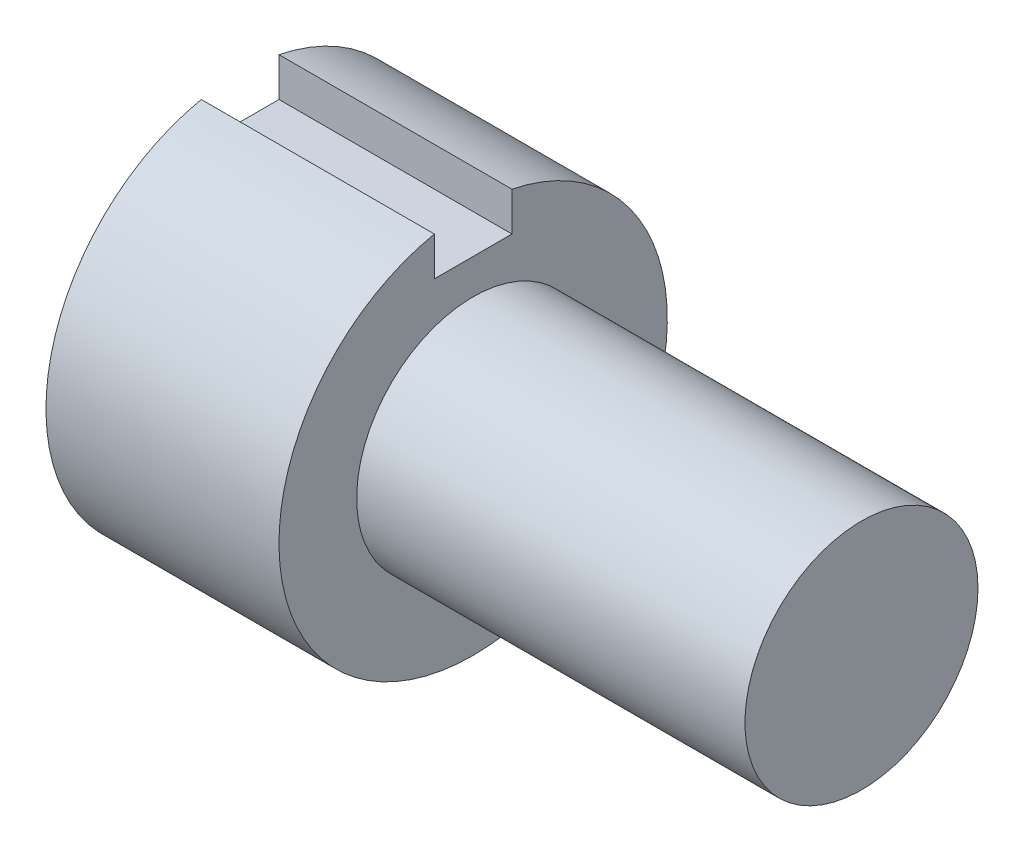
ISO-10303-21;
HEADER;
FILE_DESCRIPTION(('STEP AP214'),'2;1');
FILE_NAME('part.step','',(''),(''),'','','');
FILE_SCHEMA(('AUTOMOTIVE_DESIGN { 1 0 10303 214 1 1 1 1 }'));
ENDSEC;
DATA;
#1=APPLICATION_CONTEXT('core data for automotive mechanical design processes');
#2=APPLICATION_PROTOCOL_DEFINITION('international standard','automotive_design',2000,#1);
#3=PRODUCT_CONTEXT('',#1,'mechanical');
#4=PRODUCT('Part','Part','',(#3));
#5=PRODUCT_RELATED_PRODUCT_CATEGORY('part','',(#4));
#6=PRODUCT_DEFINITION_FORMATION('','',#4);
#7=PRODUCT_DEFINITION_CONTEXT('part definition',#1,'design');
#8=PRODUCT_DEFINITION('design','',#6,#7);
#9=PRODUCT_DEFINITION_SHAPE('','',#8);
#10=(LENGTH_UNIT() NAMED_UNIT(*) SI_UNIT(.MILLI.,.METRE.));
#11=(NAMED_UNIT(*) PLANE_ANGLE_UNIT() SI_UNIT($,.RADIAN.));
#12=(NAMED_UNIT(*) SI_UNIT($,.STERADIAN.) SOLID_ANGLE_UNIT());
#13=UNCERTAINTY_MEASURE_WITH_UNIT(LENGTH_MEASURE(1.E-05),#10,'distance_accuracy_value','');
#14=(GEOMETRIC_REPRESENTATION_CONTEXT(3) GLOBAL_UNCERTAINTY_ASSIGNED_CONTEXT((#13)) GLOBAL_UNIT_ASSIGNED_CONTEXT((#10,
#11,#12)) REPRESENTATION_CONTEXT('',''));
#15=CARTESIAN_POINT('',(0.,0.,0.));
#16=DIRECTION('',(0.,0.,1.));
#17=DIRECTION('',(1.,0.,0.));
#18=AXIS2_PLACEMENT_3D('',#15,#16,#17);
#19=CARTESIAN_POINT('',(12.,0.,0.));
#20=DIRECTION('',(-1.,0.,0.));
#21=DIRECTION('',(0.,0.,1.));
#22=AXIS2_PLACEMENT_3D('',#19,#20,#21);
#23=CYLINDRICAL_SURFACE('',#22,10.);
#24=CARTESIAN_POINT('',(12.,0.,0.));
#25=DIRECTION('',(1.,0.,0.));
#26=DIRECTION('',(0.,0.,-1.));
#27=AXIS2_PLACEMENT_3D('',#24,#25,#26);
#28=CIRCLE('',#27,10.);
#29=CARTESIAN_POINT('',(12.,9.79795897113271,2.));
#30=VERTEX_POINT('',#29);
#31=CARTESIAN_POINT('',(12.,9.79795897113271,-2.));
#32=VERTEX_POINT('',#31);
#33=EDGE_CURVE('E47',#30,#32,#28,.T.);
#34=ORIENTED_EDGE('',*,*,#33,.F.);
#35=DIRECTION('',(1.,0.,0.));
#36=VECTOR('',#35,1.);
#37=CARTESIAN_POINT('',(0.,9.79795897113271,2.));
#38=LINE('',#37,#36);
#39=CARTESIAN_POINT('',(0.,9.79795897113271,2.));
#40=VERTEX_POINT('',#39);
#41=EDGE_CURVE('E89',#40,#30,#38,.T.);
#42=ORIENTED_EDGE('',*,*,#41,.F.);
#43=CARTESIAN_POINT('',(0.,0.,0.));
#44=DIRECTION('',(1.,0.,0.));
#45=DIRECTION('',(0.,0.,-1.));
#46=AXIS2_PLACEMENT_3D('',#43,#44,#45);
#47=CIRCLE('',#46,10.);
#48=CARTESIAN_POINT('',(0.,9.79795897113271,-2.));
#49=VERTEX_POINT('',#48);
#50=EDGE_CURVE('E42',#40,#49,#47,.T.);
#51=ORIENTED_EDGE('',*,*,#50,.T.);
#52=DIRECTION('',(1.,0.,0.));
#53=VECTOR('',#52,1.);
#54=CARTESIAN_POINT('',(0.,9.79795897113271,-2.));
#55=LINE('',#54,#53);
#56=EDGE_CURVE('E81',#49,#32,#55,.T.);
#57=ORIENTED_EDGE('',*,*,#56,.T.);
#58=EDGE_LOOP('',(#34,#42,#51,#57));
#59=FACE_BOUND('',#58,.T.);
#60=ADVANCED_FACE('F39',(#59),#23,.T.);
#61=CARTESIAN_POINT('',(12.,0.,0.));
#62=DIRECTION('',(1.,0.,0.));
#63=DIRECTION('',(0.,0.,-1.));
#64=AXIS2_PLACEMENT_3D('',#61,#62,#63);
#65=PLANE('',#64);
#66=DIRECTION('',(0.,-1.,0.));
#67=VECTOR('',#66,1.);
#68=CARTESIAN_POINT('',(12.,7.79795897113271,2.));
#69=LINE('',#68,#67);
#70=CARTESIAN_POINT('',(12.,7.79795897113271,2.));
#71=VERTEX_POINT('',#70);
#72=EDGE_CURVE('E110',#30,#71,#69,.T.);
#73=ORIENTED_EDGE('',*,*,#72,.F.);
#74=ORIENTED_EDGE('',*,*,#33,.T.);
#75=DIRECTION('',(0.,1.,0.));
#76=VECTOR('',#75,1.);
#77=CARTESIAN_POINT('',(12.,7.79795897113271,-2.));
#78=LINE('',#77,#76);
#79=CARTESIAN_POINT('',(12.,7.79795897113271,-2.));
#80=VERTEX_POINT('',#79);
#81=EDGE_CURVE('E84',#80,#32,#78,.T.);
#82=ORIENTED_EDGE('',*,*,#81,.F.);
#83=DIRECTION('',(0.,0.,-1.));
#84=VECTOR('',#83,1.);
#85=CARTESIAN_POINT('',(12.,7.79795897113271,0.));
#86=LINE('',#85,#84);
#87=EDGE_CURVE('E113',#71,#80,#86,.T.);
#88=ORIENTED_EDGE('',*,*,#87,.F.);
#89=EDGE_LOOP('',(#73,#74,#82,#88));
#90=FACE_BOUND('',#89,.T.);
#91=CARTESIAN_POINT('',(12.,0.,0.));
#92=DIRECTION('',(1.,0.,0.));
#93=DIRECTION('',(0.,0.,-1.));
#94=AXIS2_PLACEMENT_3D('',#91,#92,#93);
#95=CIRCLE('',#94,6.);
#96=CARTESIAN_POINT('',(12.,0.,-6.));
#97=VERTEX_POINT('',#96);
#98=EDGE_CURVE('E11',#97,#97,#95,.T.);
#99=ORIENTED_EDGE('',*,*,#98,.F.);
#100=EDGE_LOOP('',(#99));
#101=FACE_BOUND('',#100,.T.);
#102=ADVANCED_FACE('F120',(#90,#101),#65,.T.);
#103=CARTESIAN_POINT('',(0.,0.,0.));
#104=DIRECTION('',(1.,0.,0.));
#105=DIRECTION('',(0.,0.,-1.));
#106=AXIS2_PLACEMENT_3D('',#103,#104,#105);
#107=PLANE('',#106);
#108=ORIENTED_EDGE('',*,*,#50,.F.);
#109=DIRECTION('',(0.,-1.,0.));
#110=VECTOR('',#109,1.);
#111=CARTESIAN_POINT('',(0.,7.79795897113271,2.));
#112=LINE('',#111,#110);
#113=CARTESIAN_POINT('',(0.,7.79795897113271,2.));
#114=VERTEX_POINT('',#113);
#115=EDGE_CURVE('E98',#40,#114,#112,.T.);
#116=ORIENTED_EDGE('',*,*,#115,.T.);
#117=DIRECTION('',(0.,0.,-1.));
#118=VECTOR('',#117,1.);
#119=CARTESIAN_POINT('',(0.,7.79795897113271,0.));
#120=LINE('',#119,#118);
#121=CARTESIAN_POINT('',(0.,7.79795897113271,-2.));
#122=VERTEX_POINT('',#121);
#123=EDGE_CURVE('E97',#114,#122,#120,.T.);
#124=ORIENTED_EDGE('',*,*,#123,.T.);
#125=DIRECTION('',(0.,1.,0.));
#126=VECTOR('',#125,1.);
#127=CARTESIAN_POINT('',(0.,7.79795897113271,-2.));
#128=LINE('',#127,#126);
#129=EDGE_CURVE('E55',#122,#49,#128,.T.);
#130=ORIENTED_EDGE('',*,*,#129,.T.);
#131=EDGE_LOOP('',(#108,#116,#124,#130));
#132=FACE_BOUND('',#131,.T.);
#133=ADVANCED_FACE('F95',(#132),#107,.F.);
#134=CARTESIAN_POINT('',(32.,0.,0.));
#135=DIRECTION('',(-1.,0.,0.));
#136=DIRECTION('',(0.,0.,1.));
#137=AXIS2_PLACEMENT_3D('',#134,#135,#136);
#138=CYLINDRICAL_SURFACE('',#137,6.);
#139=CARTESIAN_POINT('',(32.,0.,0.));
#140=DIRECTION('',(1.,0.,0.));
#141=DIRECTION('',(0.,0.,-1.));
#142=AXIS2_PLACEMENT_3D('',#139,#140,#141);
#143=CIRCLE('',#142,6.);
#144=CARTESIAN_POINT('',(32.,0.,-6.));
#145=VERTEX_POINT('',#144);
#146=EDGE_CURVE('E101',#145,#145,#143,.T.);
#147=ORIENTED_EDGE('',*,*,#146,.F.);
#148=EDGE_LOOP('',(#147));
#149=FACE_BOUND('',#148,.T.);
#150=ORIENTED_EDGE('',*,*,#98,.T.);
#151=EDGE_LOOP('',(#150));
#152=FACE_BOUND('',#151,.T.);
#153=ADVANCED_FACE('F139',(#149,#152),#138,.T.);
#154=CARTESIAN_POINT('',(32.,0.,0.));
#155=DIRECTION('',(1.,0.,0.));
#156=DIRECTION('',(0.,0.,-1.));
#157=AXIS2_PLACEMENT_3D('',#154,#155,#156);
#158=PLANE('',#157);
#159=ORIENTED_EDGE('',*,*,#146,.T.);
#160=EDGE_LOOP('',(#159));
#161=FACE_BOUND('',#160,.T.);
#162=ADVANCED_FACE('F142',(#161),#158,.T.);
#163=CARTESIAN_POINT('',(0.,7.79795897113271,2.));
#164=DIRECTION('',(0.,0.,1.));
#165=DIRECTION('',(1.,0.,0.));
#166=AXIS2_PLACEMENT_3D('',#163,#164,#165);
#167=PLANE('',#166);
#168=ORIENTED_EDGE('',*,*,#72,.T.);
#169=DIRECTION('',(1.,0.,0.));
#170=VECTOR('',#169,1.);
#171=CARTESIAN_POINT('',(0.,7.79795897113271,2.));
#172=LINE('',#171,#170);
#173=EDGE_CURVE('E64',#114,#71,#172,.T.);
#174=ORIENTED_EDGE('',*,*,#173,.F.);
#175=ORIENTED_EDGE('',*,*,#115,.F.);
#176=ORIENTED_EDGE('',*,*,#41,.T.);
#177=EDGE_LOOP('',(#168,#174,#175,#176));
#178=FACE_BOUND('',#177,.T.);
#179=ADVANCED_FACE('F116',(#178),#167,.F.);
#180=CARTESIAN_POINT('',(0.,7.79795897113271,-2.));
#181=DIRECTION('',(0.,0.,-1.));
#182=DIRECTION('',(-1.,0.,0.));
#183=AXIS2_PLACEMENT_3D('',#180,#181,#182);
#184=PLANE('',#183);
#185=ORIENTED_EDGE('',*,*,#81,.T.);
#186=ORIENTED_EDGE('',*,*,#56,.F.);
#187=ORIENTED_EDGE('',*,*,#129,.F.);
#188=DIRECTION('',(1.,0.,0.));
#189=VECTOR('',#188,1.);
#190=CARTESIAN_POINT('',(0.,7.79795897113271,-2.));
#191=LINE('',#190,#189);
#192=EDGE_CURVE('E90',#122,#80,#191,.T.);
#193=ORIENTED_EDGE('',*,*,#192,.T.);
#194=EDGE_LOOP('',(#185,#186,#187,#193));
#195=FACE_BOUND('',#194,.T.);
#196=ADVANCED_FACE('F82',(#195),#184,.F.);
#197=CARTESIAN_POINT('',(0.,7.79795897113271,0.));
#198=DIRECTION('',(0.,-1.,0.));
#199=DIRECTION('',(0.,0.,-1.));
#200=AXIS2_PLACEMENT_3D('',#197,#198,#199);
#201=PLANE('',#200);
#202=ORIENTED_EDGE('',*,*,#87,.T.);
#203=ORIENTED_EDGE('',*,*,#192,.F.);
#204=ORIENTED_EDGE('',*,*,#123,.F.);
#205=ORIENTED_EDGE('',*,*,#173,.T.);
#206=EDGE_LOOP('',(#202,#203,#204,#205));
#207=FACE_BOUND('',#206,.T.);
#208=ADVANCED_FACE('F122',(#207),#201,.F.);
#209=CLOSED_SHELL('',(#60,#102,#133,#153,#162,#179,#196,#208));
#210=MANIFOLD_SOLID_BREP('B2',#209);
#211=ADVANCED_BREP_SHAPE_REPRESENTATION('',(#18,#210),#14);
#212=SHAPE_DEFINITION_REPRESENTATION(#9,#211);
ENDSEC;
END-ISO-10303-21;
